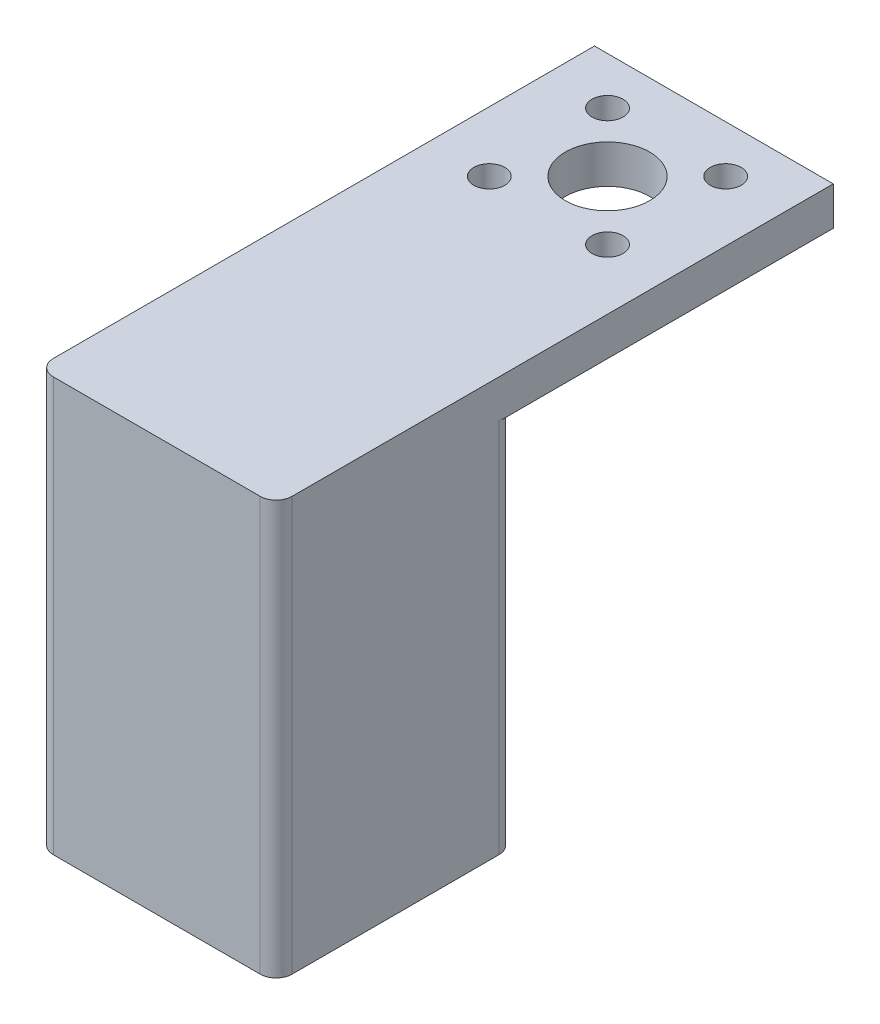
ISO-10303-21;
HEADER;
FILE_DESCRIPTION(('STEP AP214'),'2;1');
FILE_NAME('part.step','',(''),(''),'','','');
FILE_SCHEMA(('AUTOMOTIVE_DESIGN { 1 0 10303 214 1 1 1 1 }'));
ENDSEC;
DATA;
#1=APPLICATION_CONTEXT('core data for automotive mechanical design processes');
#2=APPLICATION_PROTOCOL_DEFINITION('international standard','automotive_design',2000,#1);
#3=PRODUCT_CONTEXT('',#1,'mechanical');
#4=PRODUCT('Part','Part','',(#3));
#5=PRODUCT_RELATED_PRODUCT_CATEGORY('part','',(#4));
#6=PRODUCT_DEFINITION_FORMATION('','',#4);
#7=PRODUCT_DEFINITION_CONTEXT('part definition',#1,'design');
#8=PRODUCT_DEFINITION('design','',#6,#7);
#9=PRODUCT_DEFINITION_SHAPE('','',#8);
#10=(LENGTH_UNIT() NAMED_UNIT(*) SI_UNIT(.MILLI.,.METRE.));
#11=(NAMED_UNIT(*) PLANE_ANGLE_UNIT() SI_UNIT($,.RADIAN.));
#12=(NAMED_UNIT(*) SI_UNIT($,.STERADIAN.) SOLID_ANGLE_UNIT());
#13=UNCERTAINTY_MEASURE_WITH_UNIT(LENGTH_MEASURE(1.E-05),#10,'distance_accuracy_value','');
#14=(GEOMETRIC_REPRESENTATION_CONTEXT(3) GLOBAL_UNCERTAINTY_ASSIGNED_CONTEXT((#13)) GLOBAL_UNIT_ASSIGNED_CONTEXT((#10,
#11,#12)) REPRESENTATION_CONTEXT('',''));
#15=CARTESIAN_POINT('',(0.,0.,0.));
#16=DIRECTION('',(0.,0.,1.));
#17=DIRECTION('',(1.,0.,0.));
#18=AXIS2_PLACEMENT_3D('',#15,#16,#17);
#19=CARTESIAN_POINT('',(-15.,50.,-15.));
#20=DIRECTION('',(0.,0.,1.));
#21=DIRECTION('',(1.,0.,0.));
#22=AXIS2_PLACEMENT_3D('',#19,#20,#21);
#23=PLANE('',#22);
#24=DIRECTION('',(-1.,0.,0.));
#25=VECTOR('',#24,1.);
#26=CARTESIAN_POINT('',(-15.,47.1623547697391,-15.));
#27=LINE('',#26,#25);
#28=CARTESIAN_POINT('',(13.,47.1623547697391,-15.));
#29=VERTEX_POINT('',#28);
#30=CARTESIAN_POINT('',(-13.,47.1623547697391,-15.));
#31=VERTEX_POINT('',#30);
#32=EDGE_CURVE('E185',#29,#31,#27,.T.);
#33=ORIENTED_EDGE('',*,*,#32,.F.);
#34=DIRECTION('',(0.,-1.,0.));
#35=VECTOR('',#34,1.);
#36=CARTESIAN_POINT('',(13.,50.,-15.));
#37=LINE('',#36,#35);
#38=CARTESIAN_POINT('',(13.,0.,-15.));
#39=VERTEX_POINT('',#38);
#40=EDGE_CURVE('E205',#29,#39,#37,.T.);
#41=ORIENTED_EDGE('',*,*,#40,.T.);
#42=DIRECTION('',(-1.,0.,0.));
#43=VECTOR('',#42,1.);
#44=CARTESIAN_POINT('',(-15.,0.,-15.));
#45=LINE('',#44,#43);
#46=CARTESIAN_POINT('',(-13.,0.,-15.));
#47=VERTEX_POINT('',#46);
#48=EDGE_CURVE('E275',#39,#47,#45,.T.);
#49=ORIENTED_EDGE('',*,*,#48,.T.);
#50=DIRECTION('',(0.,-1.,0.));
#51=VECTOR('',#50,1.);
#52=CARTESIAN_POINT('',(-13.,50.,-15.));
#53=LINE('',#52,#51);
#54=EDGE_CURVE('E203',#47,#31,#53,.F.);
#55=ORIENTED_EDGE('',*,*,#54,.T.);
#56=EDGE_LOOP('',(#33,#41,#49,#55));
#57=FACE_BOUND('',#56,.T.);
#58=ADVANCED_FACE('F33',(#57),#23,.F.);
#59=CARTESIAN_POINT('',(0.,0.,0.));
#60=DIRECTION('',(0.,1.,0.));
#61=DIRECTION('',(0.,0.,1.));
#62=AXIS2_PLACEMENT_3D('',#59,#60,#61);
#63=PLANE('',#62);
#64=DIRECTION('',(1.,0.,0.));
#65=VECTOR('',#64,1.);
#66=CARTESIAN_POINT('',(-15.,0.,15.));
#67=LINE('',#66,#65);
#68=CARTESIAN_POINT('',(-13.,0.,15.));
#69=VERTEX_POINT('',#68);
#70=CARTESIAN_POINT('',(13.,0.,15.));
#71=VERTEX_POINT('',#70);
#72=EDGE_CURVE('E292',#69,#71,#67,.T.);
#73=ORIENTED_EDGE('',*,*,#72,.F.);
#74=CARTESIAN_POINT('',(-13.,0.,13.));
#75=DIRECTION('',(0.,1.,0.));
#76=DIRECTION('',(0.,0.,1.));
#77=AXIS2_PLACEMENT_3D('',#74,#75,#76);
#78=CIRCLE('',#77,2.);
#79=CARTESIAN_POINT('',(-15.,0.,13.));
#80=VERTEX_POINT('',#79);
#81=EDGE_CURVE('E330',#69,#80,#78,.F.);
#82=ORIENTED_EDGE('',*,*,#81,.T.);
#83=DIRECTION('',(0.,0.,1.));
#84=VECTOR('',#83,1.);
#85=CARTESIAN_POINT('',(-15.,0.,-15.));
#86=LINE('',#85,#84);
#87=CARTESIAN_POINT('',(-15.,0.,-13.));
#88=VERTEX_POINT('',#87);
#89=EDGE_CURVE('E290',#88,#80,#86,.T.);
#90=ORIENTED_EDGE('',*,*,#89,.F.);
#91=CARTESIAN_POINT('',(-13.,0.,-13.));
#92=DIRECTION('',(0.,1.,0.));
#93=DIRECTION('',(0.,0.,1.));
#94=AXIS2_PLACEMENT_3D('',#91,#92,#93);
#95=CIRCLE('',#94,2.);
#96=EDGE_CURVE('E324',#88,#47,#95,.F.);
#97=ORIENTED_EDGE('',*,*,#96,.T.);
#98=ORIENTED_EDGE('',*,*,#48,.F.);
#99=CARTESIAN_POINT('',(13.,0.,-13.));
#100=DIRECTION('',(0.,1.,0.));
#101=DIRECTION('',(0.,0.,1.));
#102=AXIS2_PLACEMENT_3D('',#99,#100,#101);
#103=CIRCLE('',#102,2.);
#104=CARTESIAN_POINT('',(15.,0.,-13.));
#105=VERTEX_POINT('',#104);
#106=EDGE_CURVE('E326',#39,#105,#103,.F.);
#107=ORIENTED_EDGE('',*,*,#106,.T.);
#108=DIRECTION('',(0.,0.,-1.));
#109=VECTOR('',#108,1.);
#110=CARTESIAN_POINT('',(15.,0.,-15.));
#111=LINE('',#110,#109);
#112=CARTESIAN_POINT('',(15.,0.,13.));
#113=VERTEX_POINT('',#112);
#114=EDGE_CURVE('E271',#113,#105,#111,.T.);
#115=ORIENTED_EDGE('',*,*,#114,.F.);
#116=CARTESIAN_POINT('',(13.,0.,13.));
#117=DIRECTION('',(0.,1.,0.));
#118=DIRECTION('',(0.,0.,1.));
#119=AXIS2_PLACEMENT_3D('',#116,#117,#118);
#120=CIRCLE('',#119,2.);
#121=EDGE_CURVE('E328',#113,#71,#120,.F.);
#122=ORIENTED_EDGE('',*,*,#121,.T.);
#123=EDGE_LOOP('',(#73,#82,#90,#97,#98,#107,#115,#122));
#124=FACE_BOUND('',#123,.T.);
#125=DIRECTION('',(1.,0.,0.));
#126=VECTOR('',#125,1.);
#127=CARTESIAN_POINT('',(-12.,0.,12.));
#128=LINE('',#127,#126);
#129=CARTESIAN_POINT('',(-10.,0.,12.));
#130=VERTEX_POINT('',#129);
#131=CARTESIAN_POINT('',(10.,0.,12.));
#132=VERTEX_POINT('',#131);
#133=EDGE_CURVE('E249',#130,#132,#128,.T.);
#134=ORIENTED_EDGE('',*,*,#133,.T.);
#135=CARTESIAN_POINT('',(10.,0.,9.99999999999999));
#136=DIRECTION('',(0.,1.,0.));
#137=DIRECTION('',(0.,0.,1.));
#138=AXIS2_PLACEMENT_3D('',#135,#136,#137);
#139=CIRCLE('',#138,2.);
#140=CARTESIAN_POINT('',(12.,0.,9.99999999999999));
#141=VERTEX_POINT('',#140);
#142=EDGE_CURVE('E41',#132,#141,#139,.T.);
#143=ORIENTED_EDGE('',*,*,#142,.T.);
#144=DIRECTION('',(0.,0.,-1.));
#145=VECTOR('',#144,1.);
#146=CARTESIAN_POINT('',(12.,0.,-12.));
#147=LINE('',#146,#145);
#148=CARTESIAN_POINT('',(12.,0.,-9.99999999999999));
#149=VERTEX_POINT('',#148);
#150=EDGE_CURVE('E247',#141,#149,#147,.T.);
#151=ORIENTED_EDGE('',*,*,#150,.T.);
#152=CARTESIAN_POINT('',(10.,0.,-9.99999999999999));
#153=DIRECTION('',(0.,1.,0.));
#154=DIRECTION('',(0.,0.,1.));
#155=AXIS2_PLACEMENT_3D('',#152,#153,#154);
#156=CIRCLE('',#155,2.);
#157=CARTESIAN_POINT('',(10.,0.,-12.));
#158=VERTEX_POINT('',#157);
#159=EDGE_CURVE('E11',#149,#158,#156,.T.);
#160=ORIENTED_EDGE('',*,*,#159,.T.);
#161=DIRECTION('',(-1.,0.,0.));
#162=VECTOR('',#161,1.);
#163=CARTESIAN_POINT('',(-12.,0.,-12.));
#164=LINE('',#163,#162);
#165=CARTESIAN_POINT('',(-10.,0.,-12.));
#166=VERTEX_POINT('',#165);
#167=EDGE_CURVE('E258',#158,#166,#164,.T.);
#168=ORIENTED_EDGE('',*,*,#167,.T.);
#169=CARTESIAN_POINT('',(-10.,0.,-9.99999999999999));
#170=DIRECTION('',(0.,1.,0.));
#171=DIRECTION('',(0.,0.,1.));
#172=AXIS2_PLACEMENT_3D('',#169,#170,#171);
#173=CIRCLE('',#172,2.);
#174=CARTESIAN_POINT('',(-12.,0.,-9.99999999999999));
#175=VERTEX_POINT('',#174);
#176=EDGE_CURVE('E241',#166,#175,#173,.T.);
#177=ORIENTED_EDGE('',*,*,#176,.T.);
#178=DIRECTION('',(0.,0.,1.));
#179=VECTOR('',#178,1.);
#180=CARTESIAN_POINT('',(-12.,0.,-12.));
#181=LINE('',#180,#179);
#182=CARTESIAN_POINT('',(-12.,0.,9.99999999999999));
#183=VERTEX_POINT('',#182);
#184=EDGE_CURVE('E284',#175,#183,#181,.T.);
#185=ORIENTED_EDGE('',*,*,#184,.T.);
#186=CARTESIAN_POINT('',(-10.,0.,9.99999999999999));
#187=DIRECTION('',(0.,1.,0.));
#188=DIRECTION('',(0.,0.,1.));
#189=AXIS2_PLACEMENT_3D('',#186,#187,#188);
#190=CIRCLE('',#189,2.);
#191=EDGE_CURVE('E239',#183,#130,#190,.T.);
#192=ORIENTED_EDGE('',*,*,#191,.T.);
#193=EDGE_LOOP('',(#134,#143,#151,#160,#168,#177,#185,#192));
#194=FACE_BOUND('',#193,.T.);
#195=ADVANCED_FACE('F246',(#124,#194),#63,.F.);
#196=CARTESIAN_POINT('',(15.,50.,-15.));
#197=DIRECTION('',(-1.,0.,0.));
#198=DIRECTION('',(0.,0.,1.));
#199=AXIS2_PLACEMENT_3D('',#196,#197,#198);
#200=PLANE('',#199);
#201=DIRECTION('',(0.,0.,-1.));
#202=VECTOR('',#201,1.);
#203=CARTESIAN_POINT('',(15.,52.,-15.));
#204=LINE('',#203,#202);
#205=CARTESIAN_POINT('',(15.,52.,13.));
#206=VERTEX_POINT('',#205);
#207=CARTESIAN_POINT('',(15.,52.,-55.));
#208=VERTEX_POINT('',#207);
#209=EDGE_CURVE('E176',#206,#208,#204,.T.);
#210=ORIENTED_EDGE('',*,*,#209,.F.);
#211=DIRECTION('',(0.,-1.,0.));
#212=VECTOR('',#211,1.);
#213=CARTESIAN_POINT('',(15.,50.,13.));
#214=LINE('',#213,#212);
#215=EDGE_CURVE('E201',#206,#113,#214,.T.);
#216=ORIENTED_EDGE('',*,*,#215,.T.);
#217=ORIENTED_EDGE('',*,*,#114,.T.);
#218=DIRECTION('',(0.,-1.,0.));
#219=VECTOR('',#218,1.);
#220=CARTESIAN_POINT('',(15.,50.,-13.));
#221=LINE('',#220,#219);
#222=CARTESIAN_POINT('',(15.,47.1623547697391,-13.));
#223=VERTEX_POINT('',#222);
#224=EDGE_CURVE('E339',#105,#223,#221,.F.);
#225=ORIENTED_EDGE('',*,*,#224,.T.);
#226=DIRECTION('',(0.,0.,1.));
#227=VECTOR('',#226,1.);
#228=CARTESIAN_POINT('',(15.,47.1623547697391,-55.));
#229=LINE('',#228,#227);
#230=CARTESIAN_POINT('',(15.,47.1623547697391,-55.));
#231=VERTEX_POINT('',#230);
#232=EDGE_CURVE('E170',#231,#223,#229,.T.);
#233=ORIENTED_EDGE('',*,*,#232,.F.);
#234=DIRECTION('',(0.,-1.,0.));
#235=VECTOR('',#234,1.);
#236=CARTESIAN_POINT('',(15.,52.,-55.));
#237=LINE('',#236,#235);
#238=EDGE_CURVE('E179',#208,#231,#237,.T.);
#239=ORIENTED_EDGE('',*,*,#238,.F.);
#240=EDGE_LOOP('',(#210,#216,#217,#225,#233,#239));
#241=FACE_BOUND('',#240,.T.);
#242=ADVANCED_FACE('F348',(#241),#200,.F.);
#243=CARTESIAN_POINT('',(-15.,50.,-15.));
#244=DIRECTION('',(1.,0.,0.));
#245=DIRECTION('',(0.,0.,-1.));
#246=AXIS2_PLACEMENT_3D('',#243,#244,#245);
#247=PLANE('',#246);
#248=ORIENTED_EDGE('',*,*,#89,.T.);
#249=DIRECTION('',(0.,-1.,0.));
#250=VECTOR('',#249,1.);
#251=CARTESIAN_POINT('',(-15.,50.,13.));
#252=LINE('',#251,#250);
#253=CARTESIAN_POINT('',(-15.,52.,13.));
#254=VERTEX_POINT('',#253);
#255=EDGE_CURVE('E166',#80,#254,#252,.F.);
#256=ORIENTED_EDGE('',*,*,#255,.T.);
#257=DIRECTION('',(0.,0.,1.));
#258=VECTOR('',#257,1.);
#259=CARTESIAN_POINT('',(-15.,52.,-15.));
#260=LINE('',#259,#258);
#261=CARTESIAN_POINT('',(-15.,52.,-55.));
#262=VERTEX_POINT('',#261);
#263=EDGE_CURVE('E159',#262,#254,#260,.T.);
#264=ORIENTED_EDGE('',*,*,#263,.F.);
#265=DIRECTION('',(0.,1.,0.));
#266=VECTOR('',#265,1.);
#267=CARTESIAN_POINT('',(-15.,52.,-55.));
#268=LINE('',#267,#266);
#269=CARTESIAN_POINT('',(-15.,47.1623547697391,-55.));
#270=VERTEX_POINT('',#269);
#271=EDGE_CURVE('E164',#270,#262,#268,.T.);
#272=ORIENTED_EDGE('',*,*,#271,.F.);
#273=DIRECTION('',(0.,0.,1.));
#274=VECTOR('',#273,1.);
#275=CARTESIAN_POINT('',(-15.,47.1623547697391,-55.));
#276=LINE('',#275,#274);
#277=CARTESIAN_POINT('',(-15.,47.1623547697391,-13.));
#278=VERTEX_POINT('',#277);
#279=EDGE_CURVE('E196',#270,#278,#276,.T.);
#280=ORIENTED_EDGE('',*,*,#279,.T.);
#281=DIRECTION('',(0.,-1.,0.));
#282=VECTOR('',#281,1.);
#283=CARTESIAN_POINT('',(-15.,50.,-13.));
#284=LINE('',#283,#282);
#285=EDGE_CURVE('E332',#278,#88,#284,.T.);
#286=ORIENTED_EDGE('',*,*,#285,.T.);
#287=EDGE_LOOP('',(#248,#256,#264,#272,#280,#286));
#288=FACE_BOUND('',#287,.T.);
#289=ADVANCED_FACE('F162',(#288),#247,.F.);
#290=CARTESIAN_POINT('',(-15.,50.,15.));
#291=DIRECTION('',(0.,0.,-1.));
#292=DIRECTION('',(-1.,0.,0.));
#293=AXIS2_PLACEMENT_3D('',#290,#291,#292);
#294=PLANE('',#293);
#295=DIRECTION('',(1.,0.,0.));
#296=VECTOR('',#295,1.);
#297=CARTESIAN_POINT('',(-15.,52.,15.));
#298=LINE('',#297,#296);
#299=CARTESIAN_POINT('',(-13.,52.,15.));
#300=VERTEX_POINT('',#299);
#301=CARTESIAN_POINT('',(13.,52.,15.));
#302=VERTEX_POINT('',#301);
#303=EDGE_CURVE('E169',#300,#302,#298,.T.);
#304=ORIENTED_EDGE('',*,*,#303,.F.);
#305=DIRECTION('',(0.,-1.,0.));
#306=VECTOR('',#305,1.);
#307=CARTESIAN_POINT('',(-13.,50.,15.));
#308=LINE('',#307,#306);
#309=EDGE_CURVE('E321',#300,#69,#308,.T.);
#310=ORIENTED_EDGE('',*,*,#309,.T.);
#311=ORIENTED_EDGE('',*,*,#72,.T.);
#312=DIRECTION('',(0.,-1.,0.));
#313=VECTOR('',#312,1.);
#314=CARTESIAN_POINT('',(13.,50.,15.));
#315=LINE('',#314,#313);
#316=EDGE_CURVE('E295',#71,#302,#315,.F.);
#317=ORIENTED_EDGE('',*,*,#316,.T.);
#318=EDGE_LOOP('',(#304,#310,#311,#317));
#319=FACE_BOUND('',#318,.T.);
#320=ADVANCED_FACE('F372',(#319),#294,.F.);
#321=CARTESIAN_POINT('',(12.,50.,-12.));
#322=DIRECTION('',(-1.,0.,0.));
#323=DIRECTION('',(0.,0.,1.));
#324=AXIS2_PLACEMENT_3D('',#321,#322,#323);
#325=PLANE('',#324);
#326=ORIENTED_EDGE('',*,*,#150,.F.);
#327=DIRECTION('',(0.,-1.,0.));
#328=VECTOR('',#327,1.);
#329=CARTESIAN_POINT('',(12.,50.,9.99999999999999));
#330=LINE('',#329,#328);
#331=CARTESIAN_POINT('',(12.,50.,9.99999999999999));
#332=VERTEX_POINT('',#331);
#333=EDGE_CURVE('E232',#141,#332,#330,.F.);
#334=ORIENTED_EDGE('',*,*,#333,.T.);
#335=DIRECTION('',(0.,0.,-1.));
#336=VECTOR('',#335,1.);
#337=CARTESIAN_POINT('',(12.,50.,-12.));
#338=LINE('',#337,#336);
#339=CARTESIAN_POINT('',(12.,50.,-9.99999999999999));
#340=VERTEX_POINT('',#339);
#341=EDGE_CURVE('E267',#332,#340,#338,.T.);
#342=ORIENTED_EDGE('',*,*,#341,.T.);
#343=DIRECTION('',(0.,-1.,0.));
#344=VECTOR('',#343,1.);
#345=CARTESIAN_POINT('',(12.,0.,-9.99999999999999));
#346=LINE('',#345,#344);
#347=EDGE_CURVE('E229',#340,#149,#346,.T.);
#348=ORIENTED_EDGE('',*,*,#347,.T.);
#349=EDGE_LOOP('',(#326,#334,#342,#348));
#350=FACE_BOUND('',#349,.T.);
#351=ADVANCED_FACE('F254',(#350),#325,.T.);
#352=CARTESIAN_POINT('',(-12.,50.,-12.));
#353=DIRECTION('',(0.,0.,1.));
#354=DIRECTION('',(1.,0.,0.));
#355=AXIS2_PLACEMENT_3D('',#352,#353,#354);
#356=PLANE('',#355);
#357=DIRECTION('',(-1.,0.,0.));
#358=VECTOR('',#357,1.);
#359=CARTESIAN_POINT('',(-12.,50.,-12.));
#360=LINE('',#359,#358);
#361=CARTESIAN_POINT('',(10.,50.,-12.));
#362=VERTEX_POINT('',#361);
#363=CARTESIAN_POINT('',(-10.,50.,-12.));
#364=VERTEX_POINT('',#363);
#365=EDGE_CURVE('E278',#362,#364,#360,.T.);
#366=ORIENTED_EDGE('',*,*,#365,.T.);
#367=DIRECTION('',(0.,-1.,0.));
#368=VECTOR('',#367,1.);
#369=CARTESIAN_POINT('',(-10.,0.,-12.));
#370=LINE('',#369,#368);
#371=EDGE_CURVE('E226',#364,#166,#370,.T.);
#372=ORIENTED_EDGE('',*,*,#371,.T.);
#373=ORIENTED_EDGE('',*,*,#167,.F.);
#374=DIRECTION('',(0.,-1.,0.));
#375=VECTOR('',#374,1.);
#376=CARTESIAN_POINT('',(10.,50.,-12.));
#377=LINE('',#376,#375);
#378=EDGE_CURVE('E55',#158,#362,#377,.F.);
#379=ORIENTED_EDGE('',*,*,#378,.T.);
#380=EDGE_LOOP('',(#366,#372,#373,#379));
#381=FACE_BOUND('',#380,.T.);
#382=ADVANCED_FACE('F378',(#381),#356,.T.);
#383=CARTESIAN_POINT('',(-12.,50.,-12.));
#384=DIRECTION('',(1.,0.,0.));
#385=DIRECTION('',(0.,0.,-1.));
#386=AXIS2_PLACEMENT_3D('',#383,#384,#385);
#387=PLANE('',#386);
#388=DIRECTION('',(0.,0.,1.));
#389=VECTOR('',#388,1.);
#390=CARTESIAN_POINT('',(-12.,50.,-12.));
#391=LINE('',#390,#389);
#392=CARTESIAN_POINT('',(-12.,50.,-9.99999999999999));
#393=VERTEX_POINT('',#392);
#394=CARTESIAN_POINT('',(-12.,50.,9.99999999999999));
#395=VERTEX_POINT('',#394);
#396=EDGE_CURVE('E272',#393,#395,#391,.T.);
#397=ORIENTED_EDGE('',*,*,#396,.T.);
#398=DIRECTION('',(0.,-1.,0.));
#399=VECTOR('',#398,1.);
#400=CARTESIAN_POINT('',(-12.,0.,9.99999999999999));
#401=LINE('',#400,#399);
#402=EDGE_CURVE('E210',#395,#183,#401,.T.);
#403=ORIENTED_EDGE('',*,*,#402,.T.);
#404=ORIENTED_EDGE('',*,*,#184,.F.);
#405=DIRECTION('',(0.,-1.,0.));
#406=VECTOR('',#405,1.);
#407=CARTESIAN_POINT('',(-12.,50.,-9.99999999999999));
#408=LINE('',#407,#406);
#409=EDGE_CURVE('E208',#175,#393,#408,.F.);
#410=ORIENTED_EDGE('',*,*,#409,.T.);
#411=EDGE_LOOP('',(#397,#403,#404,#410));
#412=FACE_BOUND('',#411,.T.);
#413=ADVANCED_FACE('F385',(#412),#387,.T.);
#414=CARTESIAN_POINT('',(-12.,50.,12.));
#415=DIRECTION('',(0.,0.,-1.));
#416=DIRECTION('',(-1.,0.,0.));
#417=AXIS2_PLACEMENT_3D('',#414,#415,#416);
#418=PLANE('',#417);
#419=ORIENTED_EDGE('',*,*,#133,.F.);
#420=DIRECTION('',(0.,-1.,0.));
#421=VECTOR('',#420,1.);
#422=CARTESIAN_POINT('',(-10.,50.,12.));
#423=LINE('',#422,#421);
#424=CARTESIAN_POINT('',(-10.,50.,12.));
#425=VERTEX_POINT('',#424);
#426=EDGE_CURVE('E216',#130,#425,#423,.F.);
#427=ORIENTED_EDGE('',*,*,#426,.T.);
#428=DIRECTION('',(1.,0.,0.));
#429=VECTOR('',#428,1.);
#430=CARTESIAN_POINT('',(-12.,50.,12.));
#431=LINE('',#430,#429);
#432=CARTESIAN_POINT('',(10.,50.,12.));
#433=VERTEX_POINT('',#432);
#434=EDGE_CURVE('E265',#425,#433,#431,.T.);
#435=ORIENTED_EDGE('',*,*,#434,.T.);
#436=DIRECTION('',(0.,-1.,0.));
#437=VECTOR('',#436,1.);
#438=CARTESIAN_POINT('',(10.,0.,12.));
#439=LINE('',#438,#437);
#440=EDGE_CURVE('E213',#433,#132,#439,.T.);
#441=ORIENTED_EDGE('',*,*,#440,.T.);
#442=EDGE_LOOP('',(#419,#427,#435,#441));
#443=FACE_BOUND('',#442,.T.);
#444=ADVANCED_FACE('F269',(#443),#418,.T.);
#445=CARTESIAN_POINT('',(0.,50.,0.));
#446=DIRECTION('',(0.,1.,0.));
#447=DIRECTION('',(0.,0.,1.));
#448=AXIS2_PLACEMENT_3D('',#445,#446,#447);
#449=PLANE('',#448);
#450=ORIENTED_EDGE('',*,*,#434,.F.);
#451=CARTESIAN_POINT('',(-10.,50.,9.99999999999999));
#452=DIRECTION('',(0.,1.,0.));
#453=DIRECTION('',(0.,0.,1.));
#454=AXIS2_PLACEMENT_3D('',#451,#452,#453);
#455=CIRCLE('',#454,2.);
#456=EDGE_CURVE('E223',#425,#395,#455,.F.);
#457=ORIENTED_EDGE('',*,*,#456,.T.);
#458=ORIENTED_EDGE('',*,*,#396,.F.);
#459=CARTESIAN_POINT('',(-10.,50.,-9.99999999999999));
#460=DIRECTION('',(0.,1.,0.));
#461=DIRECTION('',(0.,0.,1.));
#462=AXIS2_PLACEMENT_3D('',#459,#460,#461);
#463=CIRCLE('',#462,2.);
#464=EDGE_CURVE('E48',#393,#364,#463,.F.);
#465=ORIENTED_EDGE('',*,*,#464,.T.);
#466=ORIENTED_EDGE('',*,*,#365,.F.);
#467=CARTESIAN_POINT('',(10.,50.,-9.99999999999999));
#468=DIRECTION('',(0.,1.,0.));
#469=DIRECTION('',(0.,0.,1.));
#470=AXIS2_PLACEMENT_3D('',#467,#468,#469);
#471=CIRCLE('',#470,2.);
#472=EDGE_CURVE('E218',#362,#340,#471,.F.);
#473=ORIENTED_EDGE('',*,*,#472,.T.);
#474=ORIENTED_EDGE('',*,*,#341,.F.);
#475=CARTESIAN_POINT('',(10.,50.,9.99999999999999));
#476=DIRECTION('',(0.,1.,0.));
#477=DIRECTION('',(0.,0.,1.));
#478=AXIS2_PLACEMENT_3D('',#475,#476,#477);
#479=CIRCLE('',#478,2.);
#480=EDGE_CURVE('E220',#332,#433,#479,.F.);
#481=ORIENTED_EDGE('',*,*,#480,.T.);
#482=EDGE_LOOP('',(#450,#457,#458,#465,#466,#473,#474,#481));
#483=FACE_BOUND('',#482,.T.);
#484=ADVANCED_FACE('F264',(#483),#449,.F.);
#485=CARTESIAN_POINT('',(0.,52.,0.));
#486=DIRECTION('',(0.,1.,0.));
#487=DIRECTION('',(0.,0.,1.));
#488=AXIS2_PLACEMENT_3D('',#485,#486,#487);
#489=PLANE('',#488);
#490=CARTESIAN_POINT('',(-7.42462120245875,52.,-49.0592310514427));
#491=DIRECTION('',(0.,1.,0.));
#492=DIRECTION('',(0.,0.,1.));
#493=AXIS2_PLACEMENT_3D('',#490,#491,#492);
#494=CIRCLE('',#493,1.95000000000001);
#495=CARTESIAN_POINT('',(-7.42462120245875,52.,-47.1092310514427));
#496=VERTEX_POINT('',#495);
#497=EDGE_CURVE('E319',#496,#496,#494,.T.);
#498=ORIENTED_EDGE('',*,*,#497,.F.);
#499=EDGE_LOOP('',(#498));
#500=FACE_BOUND('',#499,.T.);
#501=CARTESIAN_POINT('',(-7.42462120245875,52.,-34.2099886465252));
#502=DIRECTION('',(0.,1.,0.));
#503=DIRECTION('',(0.,0.,1.));
#504=AXIS2_PLACEMENT_3D('',#501,#502,#503);
#505=CIRCLE('',#504,1.95);
#506=CARTESIAN_POINT('',(-7.42462120245875,52.,-32.2599886465252));
#507=VERTEX_POINT('',#506);
#508=EDGE_CURVE('E315',#507,#507,#505,.T.);
#509=ORIENTED_EDGE('',*,*,#508,.F.);
#510=EDGE_LOOP('',(#509));
#511=FACE_BOUND('',#510,.T.);
#512=CARTESIAN_POINT('',(7.42462120245875,52.,-34.2099886465252));
#513=DIRECTION('',(0.,1.,0.));
#514=DIRECTION('',(0.,0.,1.));
#515=AXIS2_PLACEMENT_3D('',#512,#513,#514);
#516=CIRCLE('',#515,1.95);
#517=CARTESIAN_POINT('',(7.42462120245875,52.,-32.2599886465252));
#518=VERTEX_POINT('',#517);
#519=EDGE_CURVE('E311',#518,#518,#516,.T.);
#520=ORIENTED_EDGE('',*,*,#519,.F.);
#521=EDGE_LOOP('',(#520));
#522=FACE_BOUND('',#521,.T.);
#523=CARTESIAN_POINT('',(7.42462120245875,52.,-49.0592310514427));
#524=DIRECTION('',(0.,1.,0.));
#525=DIRECTION('',(0.,0.,1.));
#526=AXIS2_PLACEMENT_3D('',#523,#524,#525);
#527=CIRCLE('',#526,1.95);
#528=CARTESIAN_POINT('',(7.42462120245875,52.,-47.1092310514427));
#529=VERTEX_POINT('',#528);
#530=EDGE_CURVE('E307',#529,#529,#527,.T.);
#531=ORIENTED_EDGE('',*,*,#530,.F.);
#532=EDGE_LOOP('',(#531));
#533=FACE_BOUND('',#532,.T.);
#534=CARTESIAN_POINT('',(0.,52.,-41.6346098489839));
#535=DIRECTION('',(0.,1.,0.));
#536=DIRECTION('',(0.,0.,1.));
#537=AXIS2_PLACEMENT_3D('',#534,#535,#536);
#538=CIRCLE('',#537,5.3);
#539=CARTESIAN_POINT('',(0.,52.,-36.3346098489839));
#540=VERTEX_POINT('',#539);
#541=EDGE_CURVE('E191',#540,#540,#538,.T.);
#542=ORIENTED_EDGE('',*,*,#541,.F.);
#543=EDGE_LOOP('',(#542));
#544=FACE_BOUND('',#543,.T.);
#545=ORIENTED_EDGE('',*,*,#263,.T.);
#546=CARTESIAN_POINT('',(-13.,52.,13.));
#547=DIRECTION('',(0.,1.,0.));
#548=DIRECTION('',(0.,0.,1.));
#549=AXIS2_PLACEMENT_3D('',#546,#547,#548);
#550=CIRCLE('',#549,2.);
#551=EDGE_CURVE('E338',#254,#300,#550,.T.);
#552=ORIENTED_EDGE('',*,*,#551,.T.);
#553=ORIENTED_EDGE('',*,*,#303,.T.);
#554=CARTESIAN_POINT('',(13.,52.,13.));
#555=DIRECTION('',(0.,1.,0.));
#556=DIRECTION('',(0.,0.,1.));
#557=AXIS2_PLACEMENT_3D('',#554,#555,#556);
#558=CIRCLE('',#557,2.);
#559=EDGE_CURVE('E336',#302,#206,#558,.T.);
#560=ORIENTED_EDGE('',*,*,#559,.T.);
#561=ORIENTED_EDGE('',*,*,#209,.T.);
#562=DIRECTION('',(1.,0.,0.));
#563=VECTOR('',#562,1.);
#564=CARTESIAN_POINT('',(-15.,52.,-55.));
#565=LINE('',#564,#563);
#566=EDGE_CURVE('E173',#262,#208,#565,.T.);
#567=ORIENTED_EDGE('',*,*,#566,.F.);
#568=EDGE_LOOP('',(#545,#552,#553,#560,#561,#567));
#569=FACE_BOUND('',#568,.T.);
#570=ADVANCED_FACE('F174',(#500,#511,#522,#533,#544,#569),#489,.T.);
#571=CARTESIAN_POINT('',(-15.,47.1623547697391,-55.));
#572=DIRECTION('',(0.,1.,0.));
#573=DIRECTION('',(0.,0.,1.));
#574=AXIS2_PLACEMENT_3D('',#571,#572,#573);
#575=PLANE('',#574);
#576=CARTESIAN_POINT('',(-7.42462120245875,47.1623547697391,-49.0592310514427));
#577=DIRECTION('',(0.,1.,0.));
#578=DIRECTION('',(0.,0.,1.));
#579=AXIS2_PLACEMENT_3D('',#576,#577,#578);
#580=CIRCLE('',#579,1.95000000000001);
#581=CARTESIAN_POINT('',(-7.42462120245875,47.1623547697391,-47.1092310514427));
#582=VERTEX_POINT('',#581);
#583=EDGE_CURVE('E316',#582,#582,#580,.T.);
#584=ORIENTED_EDGE('',*,*,#583,.T.);
#585=EDGE_LOOP('',(#584));
#586=FACE_BOUND('',#585,.T.);
#587=CARTESIAN_POINT('',(-7.42462120245875,47.1623547697391,-34.2099886465252));
#588=DIRECTION('',(0.,1.,0.));
#589=DIRECTION('',(0.,0.,1.));
#590=AXIS2_PLACEMENT_3D('',#587,#588,#589);
#591=CIRCLE('',#590,1.95);
#592=CARTESIAN_POINT('',(-7.42462120245875,47.1623547697391,-32.2599886465252));
#593=VERTEX_POINT('',#592);
#594=EDGE_CURVE('E312',#593,#593,#591,.T.);
#595=ORIENTED_EDGE('',*,*,#594,.T.);
#596=EDGE_LOOP('',(#595));
#597=FACE_BOUND('',#596,.T.);
#598=CARTESIAN_POINT('',(7.42462120245875,47.1623547697391,-34.2099886465252));
#599=DIRECTION('',(0.,1.,0.));
#600=DIRECTION('',(0.,0.,1.));
#601=AXIS2_PLACEMENT_3D('',#598,#599,#600);
#602=CIRCLE('',#601,1.95);
#603=CARTESIAN_POINT('',(7.42462120245875,47.1623547697391,-32.2599886465252));
#604=VERTEX_POINT('',#603);
#605=EDGE_CURVE('E308',#604,#604,#602,.T.);
#606=ORIENTED_EDGE('',*,*,#605,.T.);
#607=EDGE_LOOP('',(#606));
#608=FACE_BOUND('',#607,.T.);
#609=CARTESIAN_POINT('',(7.42462120245875,47.1623547697391,-49.0592310514427));
#610=DIRECTION('',(0.,1.,0.));
#611=DIRECTION('',(0.,0.,1.));
#612=AXIS2_PLACEMENT_3D('',#609,#610,#611);
#613=CIRCLE('',#612,1.95);
#614=CARTESIAN_POINT('',(7.42462120245875,47.1623547697391,-47.1092310514427));
#615=VERTEX_POINT('',#614);
#616=EDGE_CURVE('E304',#615,#615,#613,.T.);
#617=ORIENTED_EDGE('',*,*,#616,.T.);
#618=EDGE_LOOP('',(#617));
#619=FACE_BOUND('',#618,.T.);
#620=CARTESIAN_POINT('',(0.,47.1623547697391,-41.6346098489839));
#621=DIRECTION('',(0.,1.,0.));
#622=DIRECTION('',(0.,0.,1.));
#623=AXIS2_PLACEMENT_3D('',#620,#621,#622);
#624=CIRCLE('',#623,5.3);
#625=CARTESIAN_POINT('',(0.,47.1623547697391,-36.3346098489839));
#626=VERTEX_POINT('',#625);
#627=EDGE_CURVE('E188',#626,#626,#624,.T.);
#628=ORIENTED_EDGE('',*,*,#627,.T.);
#629=EDGE_LOOP('',(#628));
#630=FACE_BOUND('',#629,.T.);
#631=ORIENTED_EDGE('',*,*,#232,.T.);
#632=CARTESIAN_POINT('',(13.,47.1623547697391,-13.));
#633=DIRECTION('',(0.,1.,0.));
#634=DIRECTION('',(0.,0.,1.));
#635=AXIS2_PLACEMENT_3D('',#632,#633,#634);
#636=CIRCLE('',#635,2.);
#637=EDGE_CURVE('E234',#223,#29,#636,.T.);
#638=ORIENTED_EDGE('',*,*,#637,.T.);
#639=ORIENTED_EDGE('',*,*,#32,.T.);
#640=CARTESIAN_POINT('',(-13.,47.1623547697391,-13.));
#641=DIRECTION('',(0.,1.,0.));
#642=DIRECTION('',(0.,0.,1.));
#643=AXIS2_PLACEMENT_3D('',#640,#641,#642);
#644=CIRCLE('',#643,2.);
#645=EDGE_CURVE('E236',#31,#278,#644,.T.);
#646=ORIENTED_EDGE('',*,*,#645,.T.);
#647=ORIENTED_EDGE('',*,*,#279,.F.);
#648=DIRECTION('',(-1.,0.,0.));
#649=VECTOR('',#648,1.);
#650=CARTESIAN_POINT('',(-15.,47.1623547697391,-55.));
#651=LINE('',#650,#649);
#652=EDGE_CURVE('E183',#231,#270,#651,.T.);
#653=ORIENTED_EDGE('',*,*,#652,.F.);
#654=EDGE_LOOP('',(#631,#638,#639,#646,#647,#653));
#655=FACE_BOUND('',#654,.T.);
#656=ADVANCED_FACE('F362',(#586,#597,#608,#619,#630,#655),#575,.F.);
#657=CARTESIAN_POINT('',(0.,0.,-55.));
#658=DIRECTION('',(0.,0.,1.));
#659=DIRECTION('',(1.,0.,0.));
#660=AXIS2_PLACEMENT_3D('',#657,#658,#659);
#661=PLANE('',#660);
#662=ORIENTED_EDGE('',*,*,#271,.T.);
#663=ORIENTED_EDGE('',*,*,#566,.T.);
#664=ORIENTED_EDGE('',*,*,#238,.T.);
#665=ORIENTED_EDGE('',*,*,#652,.T.);
#666=EDGE_LOOP('',(#662,#663,#664,#665));
#667=FACE_BOUND('',#666,.T.);
#668=ADVANCED_FACE('F181',(#667),#661,.F.);
#669=CARTESIAN_POINT('',(0.,12.,-41.6346098489839));
#670=DIRECTION('',(0.,1.,0.));
#671=DIRECTION('',(0.,0.,1.));
#672=AXIS2_PLACEMENT_3D('',#669,#670,#671);
#673=CYLINDRICAL_SURFACE('',#672,5.3);
#674=ORIENTED_EDGE('',*,*,#541,.T.);
#675=EDGE_LOOP('',(#674));
#676=FACE_BOUND('',#675,.T.);
#677=ORIENTED_EDGE('',*,*,#627,.F.);
#678=EDGE_LOOP('',(#677));
#679=FACE_BOUND('',#678,.T.);
#680=ADVANCED_FACE('F497',(#676,#679),#673,.F.);
#681=CARTESIAN_POINT('',(7.42462120245875,12.,-49.0592310514427));
#682=DIRECTION('',(0.,1.,0.));
#683=DIRECTION('',(0.,0.,1.));
#684=AXIS2_PLACEMENT_3D('',#681,#682,#683);
#685=CYLINDRICAL_SURFACE('',#684,1.95);
#686=ORIENTED_EDGE('',*,*,#530,.T.);
#687=EDGE_LOOP('',(#686));
#688=FACE_BOUND('',#687,.T.);
#689=ORIENTED_EDGE('',*,*,#616,.F.);
#690=EDGE_LOOP('',(#689));
#691=FACE_BOUND('',#690,.T.);
#692=ADVANCED_FACE('F488',(#688,#691),#685,.F.);
#693=CARTESIAN_POINT('',(7.42462120245875,12.,-34.2099886465252));
#694=DIRECTION('',(0.,1.,0.));
#695=DIRECTION('',(0.,0.,1.));
#696=AXIS2_PLACEMENT_3D('',#693,#694,#695);
#697=CYLINDRICAL_SURFACE('',#696,1.95);
#698=ORIENTED_EDGE('',*,*,#519,.T.);
#699=EDGE_LOOP('',(#698));
#700=FACE_BOUND('',#699,.T.);
#701=ORIENTED_EDGE('',*,*,#605,.F.);
#702=EDGE_LOOP('',(#701));
#703=FACE_BOUND('',#702,.T.);
#704=ADVANCED_FACE('F479',(#700,#703),#697,.F.);
#705=CARTESIAN_POINT('',(-7.42462120245875,12.,-34.2099886465252));
#706=DIRECTION('',(0.,1.,0.));
#707=DIRECTION('',(0.,0.,1.));
#708=AXIS2_PLACEMENT_3D('',#705,#706,#707);
#709=CYLINDRICAL_SURFACE('',#708,1.95);
#710=ORIENTED_EDGE('',*,*,#508,.T.);
#711=EDGE_LOOP('',(#710));
#712=FACE_BOUND('',#711,.T.);
#713=ORIENTED_EDGE('',*,*,#594,.F.);
#714=EDGE_LOOP('',(#713));
#715=FACE_BOUND('',#714,.T.);
#716=ADVANCED_FACE('F470',(#712,#715),#709,.F.);
#717=CARTESIAN_POINT('',(-7.42462120245875,12.,-49.0592310514427));
#718=DIRECTION('',(0.,1.,0.));
#719=DIRECTION('',(0.,0.,1.));
#720=AXIS2_PLACEMENT_3D('',#717,#718,#719);
#721=CYLINDRICAL_SURFACE('',#720,1.95000000000001);
#722=ORIENTED_EDGE('',*,*,#497,.T.);
#723=EDGE_LOOP('',(#722));
#724=FACE_BOUND('',#723,.T.);
#725=ORIENTED_EDGE('',*,*,#583,.F.);
#726=EDGE_LOOP('',(#725));
#727=FACE_BOUND('',#726,.T.);
#728=ADVANCED_FACE('F411',(#724,#727),#721,.F.);
#729=CARTESIAN_POINT('',(-13.,50.,13.));
#730=DIRECTION('',(0.,-1.,0.));
#731=DIRECTION('',(0.,0.,-1.));
#732=AXIS2_PLACEMENT_3D('',#729,#730,#731);
#733=CYLINDRICAL_SURFACE('',#732,2.);
#734=ORIENTED_EDGE('',*,*,#551,.F.);
#735=ORIENTED_EDGE('',*,*,#255,.F.);
#736=ORIENTED_EDGE('',*,*,#81,.F.);
#737=ORIENTED_EDGE('',*,*,#309,.F.);
#738=EDGE_LOOP('',(#734,#735,#736,#737));
#739=FACE_BOUND('',#738,.T.);
#740=ADVANCED_FACE('F369',(#739),#733,.T.);
#741=CARTESIAN_POINT('',(13.,50.,13.));
#742=DIRECTION('',(0.,-1.,0.));
#743=DIRECTION('',(0.,0.,-1.));
#744=AXIS2_PLACEMENT_3D('',#741,#742,#743);
#745=CYLINDRICAL_SURFACE('',#744,2.);
#746=ORIENTED_EDGE('',*,*,#559,.F.);
#747=ORIENTED_EDGE('',*,*,#316,.F.);
#748=ORIENTED_EDGE('',*,*,#121,.F.);
#749=ORIENTED_EDGE('',*,*,#215,.F.);
#750=EDGE_LOOP('',(#746,#747,#748,#749));
#751=FACE_BOUND('',#750,.T.);
#752=ADVANCED_FACE('F410',(#751),#745,.T.);
#753=CARTESIAN_POINT('',(13.,50.,-13.));
#754=DIRECTION('',(0.,-1.,0.));
#755=DIRECTION('',(0.,0.,-1.));
#756=AXIS2_PLACEMENT_3D('',#753,#754,#755);
#757=CYLINDRICAL_SURFACE('',#756,2.);
#758=ORIENTED_EDGE('',*,*,#637,.F.);
#759=ORIENTED_EDGE('',*,*,#224,.F.);
#760=ORIENTED_EDGE('',*,*,#106,.F.);
#761=ORIENTED_EDGE('',*,*,#40,.F.);
#762=EDGE_LOOP('',(#758,#759,#760,#761));
#763=FACE_BOUND('',#762,.T.);
#764=ADVANCED_FACE('F356',(#763),#757,.T.);
#765=CARTESIAN_POINT('',(-13.,50.,-13.));
#766=DIRECTION('',(0.,-1.,0.));
#767=DIRECTION('',(0.,0.,-1.));
#768=AXIS2_PLACEMENT_3D('',#765,#766,#767);
#769=CYLINDRICAL_SURFACE('',#768,2.);
#770=ORIENTED_EDGE('',*,*,#645,.F.);
#771=ORIENTED_EDGE('',*,*,#54,.F.);
#772=ORIENTED_EDGE('',*,*,#96,.F.);
#773=ORIENTED_EDGE('',*,*,#285,.F.);
#774=EDGE_LOOP('',(#770,#771,#772,#773));
#775=FACE_BOUND('',#774,.T.);
#776=ADVANCED_FACE('F365',(#775),#769,.T.);
#777=CARTESIAN_POINT('',(-10.,50.,9.99999999999999));
#778=DIRECTION('',(0.,1.,0.));
#779=DIRECTION('',(0.,0.,1.));
#780=AXIS2_PLACEMENT_3D('',#777,#778,#779);
#781=CYLINDRICAL_SURFACE('',#780,2.);
#782=ORIENTED_EDGE('',*,*,#456,.F.);
#783=ORIENTED_EDGE('',*,*,#426,.F.);
#784=ORIENTED_EDGE('',*,*,#191,.F.);
#785=ORIENTED_EDGE('',*,*,#402,.F.);
#786=EDGE_LOOP('',(#782,#783,#784,#785));
#787=FACE_BOUND('',#786,.T.);
#788=ADVANCED_FACE('F388',(#787),#781,.F.);
#789=CARTESIAN_POINT('',(-10.,50.,-9.99999999999999));
#790=DIRECTION('',(0.,1.,0.));
#791=DIRECTION('',(0.,0.,1.));
#792=AXIS2_PLACEMENT_3D('',#789,#790,#791);
#793=CYLINDRICAL_SURFACE('',#792,2.);
#794=ORIENTED_EDGE('',*,*,#464,.F.);
#795=ORIENTED_EDGE('',*,*,#409,.F.);
#796=ORIENTED_EDGE('',*,*,#176,.F.);
#797=ORIENTED_EDGE('',*,*,#371,.F.);
#798=EDGE_LOOP('',(#794,#795,#796,#797));
#799=FACE_BOUND('',#798,.T.);
#800=ADVANCED_FACE('F381',(#799),#793,.F.);
#801=CARTESIAN_POINT('',(10.,50.,9.99999999999999));
#802=DIRECTION('',(0.,1.,0.));
#803=DIRECTION('',(0.,0.,1.));
#804=AXIS2_PLACEMENT_3D('',#801,#802,#803);
#805=CYLINDRICAL_SURFACE('',#804,2.);
#806=ORIENTED_EDGE('',*,*,#480,.F.);
#807=ORIENTED_EDGE('',*,*,#333,.F.);
#808=ORIENTED_EDGE('',*,*,#142,.F.);
#809=ORIENTED_EDGE('',*,*,#440,.F.);
#810=EDGE_LOOP('',(#806,#807,#808,#809));
#811=FACE_BOUND('',#810,.T.);
#812=ADVANCED_FACE('F261',(#811),#805,.F.);
#813=CARTESIAN_POINT('',(10.,50.,-9.99999999999999));
#814=DIRECTION('',(0.,1.,0.));
#815=DIRECTION('',(0.,0.,1.));
#816=AXIS2_PLACEMENT_3D('',#813,#814,#815);
#817=CYLINDRICAL_SURFACE('',#816,2.);
#818=ORIENTED_EDGE('',*,*,#472,.F.);
#819=ORIENTED_EDGE('',*,*,#378,.F.);
#820=ORIENTED_EDGE('',*,*,#159,.F.);
#821=ORIENTED_EDGE('',*,*,#347,.F.);
#822=EDGE_LOOP('',(#818,#819,#820,#821));
#823=FACE_BOUND('',#822,.T.);
#824=ADVANCED_FACE('F35',(#823),#817,.F.);
#825=CLOSED_SHELL('',(#58,#195,#242,#289,#320,#351,#382,#413,#444,#484,#570,#656,#668,#680,#692,
#704,#716,#728,#740,#752,#764,#776,#788,#800,#812,#824));
#826=MANIFOLD_SOLID_BREP('B2',#825);
#827=ADVANCED_BREP_SHAPE_REPRESENTATION('',(#18,#826),#14);
#828=SHAPE_DEFINITION_REPRESENTATION(#9,#827);
ENDSEC;
END-ISO-10303-21;
